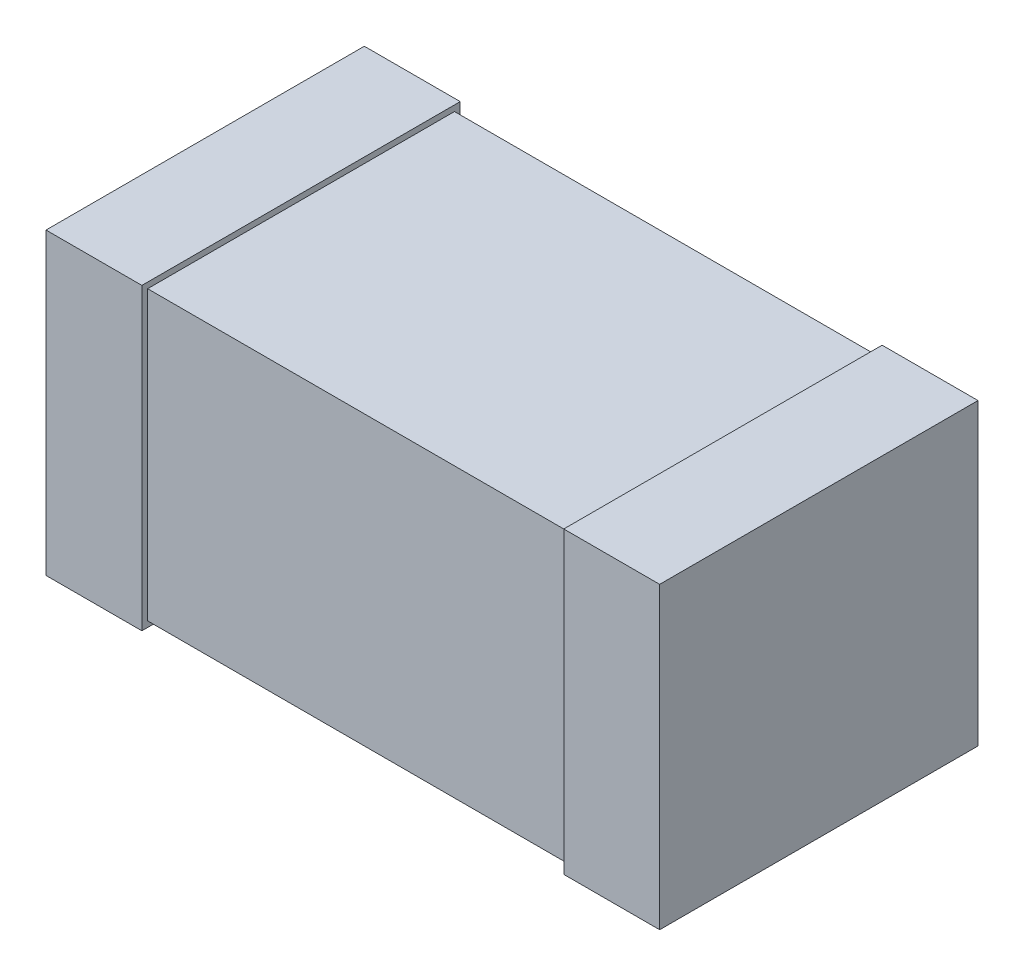
ISO-10303-21;
HEADER;
FILE_DESCRIPTION(('STEP AP214'),'2;1');
FILE_NAME('part.step','',(''),(''),'','','');
FILE_SCHEMA(('AUTOMOTIVE_DESIGN { 1 0 10303 214 1 1 1 1 }'));
ENDSEC;
DATA;
#1=APPLICATION_CONTEXT('core data for automotive mechanical design processes');
#2=APPLICATION_PROTOCOL_DEFINITION('international standard','automotive_design',2000,#1);
#3=PRODUCT_CONTEXT('',#1,'mechanical');
#4=PRODUCT('Part','Part','',(#3));
#5=PRODUCT_RELATED_PRODUCT_CATEGORY('part','',(#4));
#6=PRODUCT_DEFINITION_FORMATION('','',#4);
#7=PRODUCT_DEFINITION_CONTEXT('part definition',#1,'design');
#8=PRODUCT_DEFINITION('design','',#6,#7);
#9=PRODUCT_DEFINITION_SHAPE('','',#8);
#10=(LENGTH_UNIT() NAMED_UNIT(*) SI_UNIT(.MILLI.,.METRE.));
#11=(NAMED_UNIT(*) PLANE_ANGLE_UNIT() SI_UNIT($,.RADIAN.));
#12=(NAMED_UNIT(*) SI_UNIT($,.STERADIAN.) SOLID_ANGLE_UNIT());
#13=UNCERTAINTY_MEASURE_WITH_UNIT(LENGTH_MEASURE(1.E-05),#10,'distance_accuracy_value','');
#14=(GEOMETRIC_REPRESENTATION_CONTEXT(3) GLOBAL_UNCERTAINTY_ASSIGNED_CONTEXT((#13)) GLOBAL_UNIT_ASSIGNED_CONTEXT((#10,
#11,#12)) REPRESENTATION_CONTEXT('',''));
#15=CARTESIAN_POINT('',(0.,0.,0.));
#16=DIRECTION('',(0.,0.,1.));
#17=DIRECTION('',(1.,0.,0.));
#18=AXIS2_PLACEMENT_3D('',#15,#16,#17);
#19=CARTESIAN_POINT('',(-1.6,1.5,0.8));
#20=DIRECTION('',(0.,0.,-1.));
#21=DIRECTION('',(-1.,0.,0.));
#22=AXIS2_PLACEMENT_3D('',#19,#20,#21);
#23=PLANE('',#22);
#24=DIRECTION('',(0.,-1.,0.));
#25=VECTOR('',#24,1.);
#26=CARTESIAN_POINT('',(1.1,1.5,0.8));
#27=LINE('',#26,#25);
#28=CARTESIAN_POINT('',(1.1,1.5,0.8));
#29=VERTEX_POINT('',#28);
#30=CARTESIAN_POINT('',(1.1,0.,0.8));
#31=VERTEX_POINT('',#30);
#32=EDGE_CURVE('E51',#29,#31,#27,.T.);
#33=ORIENTED_EDGE('',*,*,#32,.F.);
#34=DIRECTION('',(1.,0.,0.));
#35=VECTOR('',#34,1.);
#36=CARTESIAN_POINT('',(-1.6,1.5,0.8));
#37=LINE('',#36,#35);
#38=CARTESIAN_POINT('',(-1.1,1.5,0.8));
#39=VERTEX_POINT('',#38);
#40=EDGE_CURVE('E216',#39,#29,#37,.T.);
#41=ORIENTED_EDGE('',*,*,#40,.F.);
#42=DIRECTION('',(0.,1.,0.));
#43=VECTOR('',#42,1.);
#44=CARTESIAN_POINT('',(-1.1,1.5,0.8));
#45=LINE('',#44,#43);
#46=CARTESIAN_POINT('',(-1.1,0.,0.8));
#47=VERTEX_POINT('',#46);
#48=EDGE_CURVE('E210',#47,#39,#45,.T.);
#49=ORIENTED_EDGE('',*,*,#48,.F.);
#50=DIRECTION('',(1.,0.,0.));
#51=VECTOR('',#50,1.);
#52=CARTESIAN_POINT('',(-1.6,0.,0.8));
#53=LINE('',#52,#51);
#54=EDGE_CURVE('E215',#47,#31,#53,.T.);
#55=ORIENTED_EDGE('',*,*,#54,.T.);
#56=EDGE_LOOP('',(#33,#41,#49,#55));
#57=FACE_BOUND('',#56,.T.);
#58=ADVANCED_FACE('F36',(#57),#23,.F.);
#59=CARTESIAN_POINT('',(-1.6,1.5,-0.8));
#60=DIRECTION('',(0.,0.,1.));
#61=DIRECTION('',(1.,0.,0.));
#62=AXIS2_PLACEMENT_3D('',#59,#60,#61);
#63=PLANE('',#62);
#64=DIRECTION('',(0.,1.,0.));
#65=VECTOR('',#64,1.);
#66=CARTESIAN_POINT('',(1.1,1.5,-0.8));
#67=LINE('',#66,#65);
#68=CARTESIAN_POINT('',(1.1,0.,-0.8));
#69=VERTEX_POINT('',#68);
#70=CARTESIAN_POINT('',(1.1,1.5,-0.8));
#71=VERTEX_POINT('',#70);
#72=EDGE_CURVE('E165',#69,#71,#67,.T.);
#73=ORIENTED_EDGE('',*,*,#72,.F.);
#74=DIRECTION('',(-1.,0.,0.));
#75=VECTOR('',#74,1.);
#76=CARTESIAN_POINT('',(-1.6,0.,-0.8));
#77=LINE('',#76,#75);
#78=CARTESIAN_POINT('',(-1.1,0.,-0.8));
#79=VERTEX_POINT('',#78);
#80=EDGE_CURVE('E219',#69,#79,#77,.T.);
#81=ORIENTED_EDGE('',*,*,#80,.T.);
#82=DIRECTION('',(0.,-1.,0.));
#83=VECTOR('',#82,1.);
#84=CARTESIAN_POINT('',(-1.1,1.5,-0.8));
#85=LINE('',#84,#83);
#86=CARTESIAN_POINT('',(-1.1,1.5,-0.8));
#87=VERTEX_POINT('',#86);
#88=EDGE_CURVE('E198',#87,#79,#85,.T.);
#89=ORIENTED_EDGE('',*,*,#88,.F.);
#90=DIRECTION('',(-1.,0.,0.));
#91=VECTOR('',#90,1.);
#92=CARTESIAN_POINT('',(-1.6,1.5,-0.8));
#93=LINE('',#92,#91);
#94=EDGE_CURVE('E218',#71,#87,#93,.T.);
#95=ORIENTED_EDGE('',*,*,#94,.F.);
#96=EDGE_LOOP('',(#73,#81,#89,#95));
#97=FACE_BOUND('',#96,.T.);
#98=ADVANCED_FACE('F236',(#97),#63,.F.);
#99=CARTESIAN_POINT('',(-1.6,1.5,0.8));
#100=DIRECTION('',(0.,1.,0.));
#101=DIRECTION('',(0.,0.,1.));
#102=AXIS2_PLACEMENT_3D('',#99,#100,#101);
#103=PLANE('',#102);
#104=ORIENTED_EDGE('',*,*,#40,.T.);
#105=DIRECTION('',(0.,0.,-1.));
#106=VECTOR('',#105,1.);
#107=CARTESIAN_POINT('',(1.1,1.5,0.8));
#108=LINE('',#107,#106);
#109=EDGE_CURVE('E58',#29,#71,#108,.T.);
#110=ORIENTED_EDGE('',*,*,#109,.T.);
#111=ORIENTED_EDGE('',*,*,#94,.T.);
#112=DIRECTION('',(0.,0.,1.));
#113=VECTOR('',#112,1.);
#114=CARTESIAN_POINT('',(-1.1,1.5,0.8));
#115=LINE('',#114,#113);
#116=EDGE_CURVE('E213',#87,#39,#115,.T.);
#117=ORIENTED_EDGE('',*,*,#116,.T.);
#118=EDGE_LOOP('',(#104,#110,#111,#117));
#119=FACE_BOUND('',#118,.T.);
#120=ADVANCED_FACE('F233',(#119),#103,.T.);
#121=CARTESIAN_POINT('',(-1.6,0.,0.8));
#122=DIRECTION('',(0.,1.,0.));
#123=DIRECTION('',(0.,0.,1.));
#124=AXIS2_PLACEMENT_3D('',#121,#122,#123);
#125=PLANE('',#124);
#126=DIRECTION('',(0.,0.,-1.));
#127=VECTOR('',#126,1.);
#128=CARTESIAN_POINT('',(1.1,0.,0.8));
#129=LINE('',#128,#127);
#130=EDGE_CURVE('E12',#31,#69,#129,.T.);
#131=ORIENTED_EDGE('',*,*,#130,.F.);
#132=ORIENTED_EDGE('',*,*,#54,.F.);
#133=DIRECTION('',(0.,0.,1.));
#134=VECTOR('',#133,1.);
#135=CARTESIAN_POINT('',(-1.1,0.,0.8));
#136=LINE('',#135,#134);
#137=EDGE_CURVE('E44',#79,#47,#136,.T.);
#138=ORIENTED_EDGE('',*,*,#137,.F.);
#139=ORIENTED_EDGE('',*,*,#80,.F.);
#140=EDGE_LOOP('',(#131,#132,#138,#139));
#141=FACE_BOUND('',#140,.T.);
#142=ADVANCED_FACE('F231',(#141),#125,.F.);
#143=CARTESIAN_POINT('',(-1.1,-0.03,2.49816971037802));
#144=DIRECTION('',(0.,1.,0.));
#145=DIRECTION('',(-1.,0.,0.));
#146=AXIS2_PLACEMENT_3D('',#143,#144,#145);
#147=PLANE('',#146);
#148=DIRECTION('',(0.,0.,-1.));
#149=VECTOR('',#148,1.);
#150=CARTESIAN_POINT('',(-1.1,-0.03,2.49816971037802));
#151=LINE('',#150,#149);
#152=CARTESIAN_POINT('',(-1.1,-0.03,0.83));
#153=VERTEX_POINT('',#152);
#154=CARTESIAN_POINT('',(-1.1,-0.03,-0.83));
#155=VERTEX_POINT('',#154);
#156=EDGE_CURVE('E187',#153,#155,#151,.T.);
#157=ORIENTED_EDGE('',*,*,#156,.F.);
#158=DIRECTION('',(-1.,0.,0.));
#159=VECTOR('',#158,1.);
#160=CARTESIAN_POINT('',(-1.1,-0.03,0.83));
#161=LINE('',#160,#159);
#162=CARTESIAN_POINT('',(-1.6,-0.0300000000000001,0.83));
#163=VERTEX_POINT('',#162);
#164=EDGE_CURVE('E192',#153,#163,#161,.T.);
#165=ORIENTED_EDGE('',*,*,#164,.T.);
#166=DIRECTION('',(0.,0.,-1.));
#167=VECTOR('',#166,1.);
#168=CARTESIAN_POINT('',(-1.6,-0.0300000000000001,2.49816971037802));
#169=LINE('',#168,#167);
#170=CARTESIAN_POINT('',(-1.6,-0.0300000000000001,-0.83));
#171=VERTEX_POINT('',#170);
#172=EDGE_CURVE('E200',#163,#171,#169,.T.);
#173=ORIENTED_EDGE('',*,*,#172,.T.);
#174=DIRECTION('',(-1.,0.,0.));
#175=VECTOR('',#174,1.);
#176=CARTESIAN_POINT('',(-1.1,-0.03,-0.83));
#177=LINE('',#176,#175);
#178=EDGE_CURVE('E178',#155,#171,#177,.T.);
#179=ORIENTED_EDGE('',*,*,#178,.F.);
#180=EDGE_LOOP('',(#157,#165,#173,#179));
#181=FACE_BOUND('',#180,.T.);
#182=ADVANCED_FACE('F277',(#181),#147,.F.);
#183=CARTESIAN_POINT('',(-1.1,1.53,2.49816971037802));
#184=DIRECTION('',(0.,-1.,0.));
#185=DIRECTION('',(0.,0.,-1.));
#186=AXIS2_PLACEMENT_3D('',#183,#184,#185);
#187=PLANE('',#186);
#188=DIRECTION('',(0.,0.,-1.));
#189=VECTOR('',#188,1.);
#190=CARTESIAN_POINT('',(-1.6,1.53,2.49816971037802));
#191=LINE('',#190,#189);
#192=CARTESIAN_POINT('',(-1.6,1.53,0.83));
#193=VERTEX_POINT('',#192);
#194=CARTESIAN_POINT('',(-1.6,1.53,-0.83));
#195=VERTEX_POINT('',#194);
#196=EDGE_CURVE('E202',#193,#195,#191,.T.);
#197=ORIENTED_EDGE('',*,*,#196,.F.);
#198=DIRECTION('',(1.,0.,0.));
#199=VECTOR('',#198,1.);
#200=CARTESIAN_POINT('',(-1.1,1.53,0.83));
#201=LINE('',#200,#199);
#202=CARTESIAN_POINT('',(-1.1,1.53,0.83));
#203=VERTEX_POINT('',#202);
#204=EDGE_CURVE('E191',#193,#203,#201,.T.);
#205=ORIENTED_EDGE('',*,*,#204,.T.);
#206=DIRECTION('',(0.,0.,-1.));
#207=VECTOR('',#206,1.);
#208=CARTESIAN_POINT('',(-1.1,1.53,2.49816971037802));
#209=LINE('',#208,#207);
#210=CARTESIAN_POINT('',(-1.1,1.53,-0.83));
#211=VERTEX_POINT('',#210);
#212=EDGE_CURVE('E204',#203,#211,#209,.T.);
#213=ORIENTED_EDGE('',*,*,#212,.T.);
#214=DIRECTION('',(1.,0.,0.));
#215=VECTOR('',#214,1.);
#216=CARTESIAN_POINT('',(-1.1,1.53,-0.83));
#217=LINE('',#216,#215);
#218=EDGE_CURVE('E184',#195,#211,#217,.T.);
#219=ORIENTED_EDGE('',*,*,#218,.F.);
#220=EDGE_LOOP('',(#197,#205,#213,#219));
#221=FACE_BOUND('',#220,.T.);
#222=ADVANCED_FACE('F280',(#221),#187,.F.);
#223=CARTESIAN_POINT('',(-1.1,1.53,2.49816971037802));
#224=DIRECTION('',(-1.,0.,0.));
#225=DIRECTION('',(0.,-1.,0.));
#226=AXIS2_PLACEMENT_3D('',#223,#224,#225);
#227=PLANE('',#226);
#228=ORIENTED_EDGE('',*,*,#116,.F.);
#229=ORIENTED_EDGE('',*,*,#88,.T.);
#230=ORIENTED_EDGE('',*,*,#137,.T.);
#231=ORIENTED_EDGE('',*,*,#48,.T.);
#232=EDGE_LOOP('',(#228,#229,#230,#231));
#233=FACE_BOUND('',#232,.T.);
#234=ORIENTED_EDGE('',*,*,#212,.F.);
#235=DIRECTION('',(0.,-1.,0.));
#236=VECTOR('',#235,1.);
#237=CARTESIAN_POINT('',(-1.1,1.53,0.83));
#238=LINE('',#237,#236);
#239=EDGE_CURVE('E195',#203,#153,#238,.T.);
#240=ORIENTED_EDGE('',*,*,#239,.T.);
#241=ORIENTED_EDGE('',*,*,#156,.T.);
#242=DIRECTION('',(0.,-1.,0.));
#243=VECTOR('',#242,1.);
#244=CARTESIAN_POINT('',(-1.1,1.53,-0.83));
#245=LINE('',#244,#243);
#246=EDGE_CURVE('E181',#211,#155,#245,.T.);
#247=ORIENTED_EDGE('',*,*,#246,.F.);
#248=EDGE_LOOP('',(#234,#240,#241,#247));
#249=FACE_BOUND('',#248,.T.);
#250=ADVANCED_FACE('F226',(#233,#249),#227,.F.);
#251=CARTESIAN_POINT('',(-1.6,1.5,0.83));
#252=DIRECTION('',(0.,0.,-1.));
#253=DIRECTION('',(-1.,0.,0.));
#254=AXIS2_PLACEMENT_3D('',#251,#252,#253);
#255=PLANE('',#254);
#256=ORIENTED_EDGE('',*,*,#204,.F.);
#257=DIRECTION('',(0.,1.,0.));
#258=VECTOR('',#257,1.);
#259=CARTESIAN_POINT('',(-1.6,1.53,0.83));
#260=LINE('',#259,#258);
#261=EDGE_CURVE('E188',#163,#193,#260,.T.);
#262=ORIENTED_EDGE('',*,*,#261,.F.);
#263=ORIENTED_EDGE('',*,*,#164,.F.);
#264=ORIENTED_EDGE('',*,*,#239,.F.);
#265=EDGE_LOOP('',(#256,#262,#263,#264));
#266=FACE_BOUND('',#265,.T.);
#267=ADVANCED_FACE('F272',(#266),#255,.F.);
#268=CARTESIAN_POINT('',(-1.6,1.5,-0.83));
#269=DIRECTION('',(0.,0.,1.));
#270=DIRECTION('',(1.,0.,0.));
#271=AXIS2_PLACEMENT_3D('',#268,#269,#270);
#272=PLANE('',#271);
#273=ORIENTED_EDGE('',*,*,#246,.T.);
#274=ORIENTED_EDGE('',*,*,#178,.T.);
#275=DIRECTION('',(0.,1.,0.));
#276=VECTOR('',#275,1.);
#277=CARTESIAN_POINT('',(-1.6,1.53,-0.83));
#278=LINE('',#277,#276);
#279=EDGE_CURVE('E175',#171,#195,#278,.T.);
#280=ORIENTED_EDGE('',*,*,#279,.T.);
#281=ORIENTED_EDGE('',*,*,#218,.T.);
#282=EDGE_LOOP('',(#273,#274,#280,#281));
#283=FACE_BOUND('',#282,.T.);
#284=ADVANCED_FACE('F269',(#283),#272,.F.);
#285=CARTESIAN_POINT('',(-1.6,1.5,-0.8));
#286=DIRECTION('',(1.,0.,0.));
#287=DIRECTION('',(0.,0.,-1.));
#288=AXIS2_PLACEMENT_3D('',#285,#286,#287);
#289=PLANE('',#288);
#290=ORIENTED_EDGE('',*,*,#172,.F.);
#291=ORIENTED_EDGE('',*,*,#261,.T.);
#292=ORIENTED_EDGE('',*,*,#196,.T.);
#293=ORIENTED_EDGE('',*,*,#279,.F.);
#294=EDGE_LOOP('',(#290,#291,#292,#293));
#295=FACE_BOUND('',#294,.T.);
#296=ADVANCED_FACE('F38',(#295),#289,.F.);
#297=CARTESIAN_POINT('',(1.1,-0.0299999999999997,2.49816971037802));
#298=DIRECTION('',(0.,1.,0.));
#299=DIRECTION('',(-1.,0.,0.));
#300=AXIS2_PLACEMENT_3D('',#297,#298,#299);
#301=PLANE('',#300);
#302=DIRECTION('',(0.,0.,-1.));
#303=VECTOR('',#302,1.);
#304=CARTESIAN_POINT('',(1.6,-0.0299999999999997,2.49816971037802));
#305=LINE('',#304,#303);
#306=CARTESIAN_POINT('',(1.6,-0.0299999999999997,0.83));
#307=VERTEX_POINT('',#306);
#308=CARTESIAN_POINT('',(1.6,-0.0299999999999997,-0.83));
#309=VERTEX_POINT('',#308);
#310=EDGE_CURVE('E138',#307,#309,#305,.T.);
#311=ORIENTED_EDGE('',*,*,#310,.F.);
#312=DIRECTION('',(-1.,0.,0.));
#313=VECTOR('',#312,1.);
#314=CARTESIAN_POINT('',(1.1,-0.0299999999999997,0.83));
#315=LINE('',#314,#313);
#316=CARTESIAN_POINT('',(1.1,-0.0299999999999997,0.83));
#317=VERTEX_POINT('',#316);
#318=EDGE_CURVE('E133',#307,#317,#315,.T.);
#319=ORIENTED_EDGE('',*,*,#318,.T.);
#320=DIRECTION('',(0.,0.,-1.));
#321=VECTOR('',#320,1.);
#322=CARTESIAN_POINT('',(1.1,-0.0299999999999997,2.49816971037802));
#323=LINE('',#322,#321);
#324=CARTESIAN_POINT('',(1.1,-0.0299999999999997,-0.83));
#325=VERTEX_POINT('',#324);
#326=EDGE_CURVE('E128',#317,#325,#323,.T.);
#327=ORIENTED_EDGE('',*,*,#326,.T.);
#328=DIRECTION('',(-1.,0.,0.));
#329=VECTOR('',#328,1.);
#330=CARTESIAN_POINT('',(1.1,-0.0299999999999997,-0.83));
#331=LINE('',#330,#329);
#332=EDGE_CURVE('E132',#309,#325,#331,.T.);
#333=ORIENTED_EDGE('',*,*,#332,.F.);
#334=EDGE_LOOP('',(#311,#319,#327,#333));
#335=FACE_BOUND('',#334,.T.);
#336=ADVANCED_FACE('F131',(#335),#301,.F.);
#337=CARTESIAN_POINT('',(1.1,1.53,2.49816971037802));
#338=DIRECTION('',(1.,0.,0.));
#339=DIRECTION('',(0.,1.,0.));
#340=AXIS2_PLACEMENT_3D('',#337,#338,#339);
#341=PLANE('',#340);
#342=ORIENTED_EDGE('',*,*,#109,.F.);
#343=ORIENTED_EDGE('',*,*,#32,.T.);
#344=ORIENTED_EDGE('',*,*,#130,.T.);
#345=ORIENTED_EDGE('',*,*,#72,.T.);
#346=EDGE_LOOP('',(#342,#343,#344,#345));
#347=FACE_BOUND('',#346,.T.);
#348=ORIENTED_EDGE('',*,*,#326,.F.);
#349=DIRECTION('',(0.,1.,0.));
#350=VECTOR('',#349,1.);
#351=CARTESIAN_POINT('',(1.1,1.53,0.83));
#352=LINE('',#351,#350);
#353=CARTESIAN_POINT('',(1.1,1.53,0.83));
#354=VERTEX_POINT('',#353);
#355=EDGE_CURVE('E160',#317,#354,#352,.T.);
#356=ORIENTED_EDGE('',*,*,#355,.T.);
#357=DIRECTION('',(0.,0.,-1.));
#358=VECTOR('',#357,1.);
#359=CARTESIAN_POINT('',(1.1,1.53,2.49816971037802));
#360=LINE('',#359,#358);
#361=CARTESIAN_POINT('',(1.1,1.53,-0.83));
#362=VERTEX_POINT('',#361);
#363=EDGE_CURVE('E137',#354,#362,#360,.T.);
#364=ORIENTED_EDGE('',*,*,#363,.T.);
#365=DIRECTION('',(0.,1.,0.));
#366=VECTOR('',#365,1.);
#367=CARTESIAN_POINT('',(1.1,1.53,-0.83));
#368=LINE('',#367,#366);
#369=EDGE_CURVE('E145',#325,#362,#368,.T.);
#370=ORIENTED_EDGE('',*,*,#369,.F.);
#371=EDGE_LOOP('',(#348,#356,#364,#370));
#372=FACE_BOUND('',#371,.T.);
#373=ADVANCED_FACE('F150',(#347,#372),#341,.F.);
#374=CARTESIAN_POINT('',(1.1,1.53,2.49816971037802));
#375=DIRECTION('',(0.,-1.,0.));
#376=DIRECTION('',(1.,0.,0.));
#377=AXIS2_PLACEMENT_3D('',#374,#375,#376);
#378=PLANE('',#377);
#379=ORIENTED_EDGE('',*,*,#363,.F.);
#380=DIRECTION('',(1.,0.,0.));
#381=VECTOR('',#380,1.);
#382=CARTESIAN_POINT('',(1.1,1.53,0.83));
#383=LINE('',#382,#381);
#384=CARTESIAN_POINT('',(1.6,1.53,0.83));
#385=VERTEX_POINT('',#384);
#386=EDGE_CURVE('E163',#354,#385,#383,.T.);
#387=ORIENTED_EDGE('',*,*,#386,.T.);
#388=DIRECTION('',(0.,0.,-1.));
#389=VECTOR('',#388,1.);
#390=CARTESIAN_POINT('',(1.6,1.53,2.49816971037802));
#391=LINE('',#390,#389);
#392=CARTESIAN_POINT('',(1.6,1.53,-0.83));
#393=VERTEX_POINT('',#392);
#394=EDGE_CURVE('E152',#385,#393,#391,.T.);
#395=ORIENTED_EDGE('',*,*,#394,.T.);
#396=DIRECTION('',(1.,0.,0.));
#397=VECTOR('',#396,1.);
#398=CARTESIAN_POINT('',(1.1,1.53,-0.83));
#399=LINE('',#398,#397);
#400=EDGE_CURVE('E153',#362,#393,#399,.T.);
#401=ORIENTED_EDGE('',*,*,#400,.F.);
#402=EDGE_LOOP('',(#379,#387,#395,#401));
#403=FACE_BOUND('',#402,.T.);
#404=ADVANCED_FACE('F256',(#403),#378,.F.);
#405=CARTESIAN_POINT('',(-1.6,1.5,0.83));
#406=DIRECTION('',(0.,0.,-1.));
#407=DIRECTION('',(-1.,0.,0.));
#408=AXIS2_PLACEMENT_3D('',#405,#406,#407);
#409=PLANE('',#408);
#410=ORIENTED_EDGE('',*,*,#355,.F.);
#411=ORIENTED_EDGE('',*,*,#318,.F.);
#412=DIRECTION('',(0.,-1.,0.));
#413=VECTOR('',#412,1.);
#414=CARTESIAN_POINT('',(1.6,1.53,0.83));
#415=LINE('',#414,#413);
#416=EDGE_CURVE('E161',#385,#307,#415,.T.);
#417=ORIENTED_EDGE('',*,*,#416,.F.);
#418=ORIENTED_EDGE('',*,*,#386,.F.);
#419=EDGE_LOOP('',(#410,#411,#417,#418));
#420=FACE_BOUND('',#419,.T.);
#421=ADVANCED_FACE('F252',(#420),#409,.F.);
#422=CARTESIAN_POINT('',(-1.6,1.5,-0.83));
#423=DIRECTION('',(0.,0.,1.));
#424=DIRECTION('',(1.,0.,0.));
#425=AXIS2_PLACEMENT_3D('',#422,#423,#424);
#426=PLANE('',#425);
#427=ORIENTED_EDGE('',*,*,#400,.T.);
#428=DIRECTION('',(0.,-1.,0.));
#429=VECTOR('',#428,1.);
#430=CARTESIAN_POINT('',(1.6,1.53,-0.83));
#431=LINE('',#430,#429);
#432=EDGE_CURVE('E148',#393,#309,#431,.T.);
#433=ORIENTED_EDGE('',*,*,#432,.T.);
#434=ORIENTED_EDGE('',*,*,#332,.T.);
#435=ORIENTED_EDGE('',*,*,#369,.T.);
#436=EDGE_LOOP('',(#427,#433,#434,#435));
#437=FACE_BOUND('',#436,.T.);
#438=ADVANCED_FACE('F144',(#437),#426,.F.);
#439=CARTESIAN_POINT('',(1.6,1.5,-0.8));
#440=DIRECTION('',(-1.,0.,0.));
#441=DIRECTION('',(0.,0.,1.));
#442=AXIS2_PLACEMENT_3D('',#439,#440,#441);
#443=PLANE('',#442);
#444=ORIENTED_EDGE('',*,*,#394,.F.);
#445=ORIENTED_EDGE('',*,*,#416,.T.);
#446=ORIENTED_EDGE('',*,*,#310,.T.);
#447=ORIENTED_EDGE('',*,*,#432,.F.);
#448=EDGE_LOOP('',(#444,#445,#446,#447));
#449=FACE_BOUND('',#448,.T.);
#450=ADVANCED_FACE('F246',(#449),#443,.F.);
#451=CLOSED_SHELL('',(#58,#98,#120,#142,#182,#222,#250,#267,#284,#296,#336,#373,#404,#421,#438,#450));
#452=MANIFOLD_SOLID_BREP('B2',#451);
#453=ADVANCED_BREP_SHAPE_REPRESENTATION('',(#18,#452),#14);
#454=SHAPE_DEFINITION_REPRESENTATION(#9,#453);
ENDSEC;
END-ISO-10303-21;
